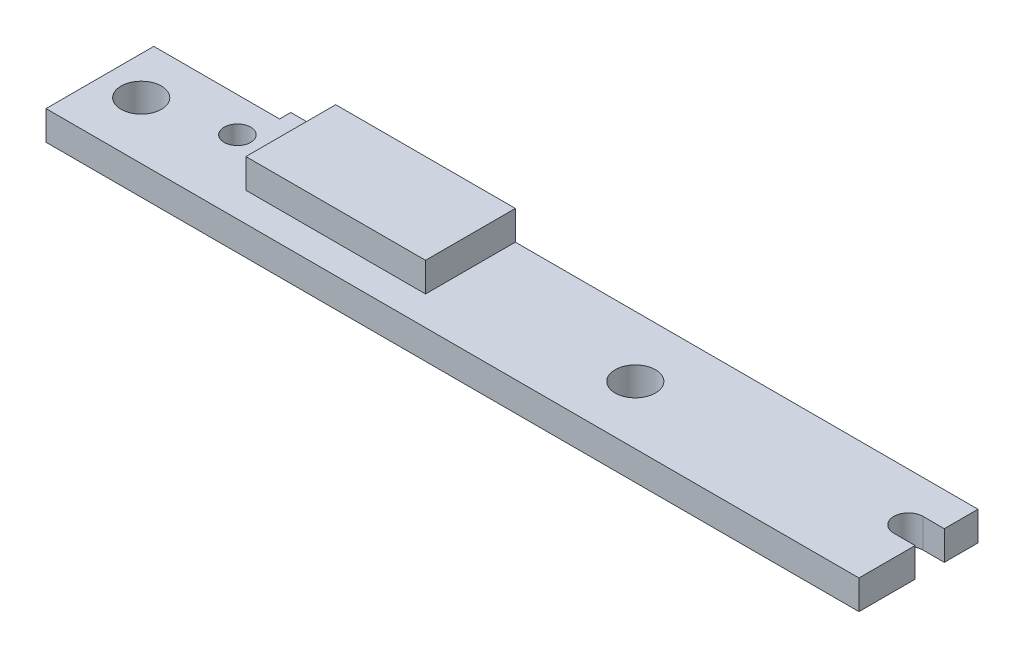
ISO-10303-21;
HEADER;
FILE_DESCRIPTION(('STEP AP214'),'2;1');
FILE_NAME('part.step','',(''),(''),'','','');
FILE_SCHEMA(('AUTOMOTIVE_DESIGN { 1 0 10303 214 1 1 1 1 }'));
ENDSEC;
DATA;
#1=APPLICATION_CONTEXT('core data for automotive mechanical design processes');
#2=APPLICATION_PROTOCOL_DEFINITION('international standard','automotive_design',2000,#1);
#3=PRODUCT_CONTEXT('',#1,'mechanical');
#4=PRODUCT('Part','Part','',(#3));
#5=PRODUCT_RELATED_PRODUCT_CATEGORY('part','',(#4));
#6=PRODUCT_DEFINITION_FORMATION('','',#4);
#7=PRODUCT_DEFINITION_CONTEXT('part definition',#1,'design');
#8=PRODUCT_DEFINITION('design','',#6,#7);
#9=PRODUCT_DEFINITION_SHAPE('','',#8);
#10=(LENGTH_UNIT() NAMED_UNIT(*) SI_UNIT(.MILLI.,.METRE.));
#11=(NAMED_UNIT(*) PLANE_ANGLE_UNIT() SI_UNIT($,.RADIAN.));
#12=(NAMED_UNIT(*) SI_UNIT($,.STERADIAN.) SOLID_ANGLE_UNIT());
#13=UNCERTAINTY_MEASURE_WITH_UNIT(LENGTH_MEASURE(1.E-05),#10,'distance_accuracy_value','');
#14=(GEOMETRIC_REPRESENTATION_CONTEXT(3) GLOBAL_UNCERTAINTY_ASSIGNED_CONTEXT((#13)) GLOBAL_UNIT_ASSIGNED_CONTEXT((#10,
#11,#12)) REPRESENTATION_CONTEXT('',''));
#15=CARTESIAN_POINT('',(0.,0.,0.));
#16=DIRECTION('',(0.,0.,1.));
#17=DIRECTION('',(1.,0.,0.));
#18=AXIS2_PLACEMENT_3D('',#15,#16,#17);
#19=CARTESIAN_POINT('',(44.7675,1.651,-4.0005));
#20=DIRECTION('',(0.,-1.,0.));
#21=DIRECTION('',(0.,0.,-1.));
#22=AXIS2_PLACEMENT_3D('',#19,#20,#21);
#23=CYLINDRICAL_SURFACE('',#22,0.8255);
#24=CARTESIAN_POINT('',(44.7675,0.,-4.0005));
#25=DIRECTION('',(0.,1.,0.));
#26=DIRECTION('',(0.,0.,1.));
#27=AXIS2_PLACEMENT_3D('',#24,#25,#26);
#28=CIRCLE('',#27,0.8255);
#29=CARTESIAN_POINT('',(44.7675,0.,-4.826));
#30=VERTEX_POINT('',#29);
#31=CARTESIAN_POINT('',(44.7675,0.,-3.175));
#32=VERTEX_POINT('',#31);
#33=EDGE_CURVE('E192',#30,#32,#28,.T.);
#34=ORIENTED_EDGE('',*,*,#33,.F.);
#35=DIRECTION('',(0.,-1.,0.));
#36=VECTOR('',#35,1.);
#37=CARTESIAN_POINT('',(44.7675,1.651,-4.826));
#38=LINE('',#37,#36);
#39=CARTESIAN_POINT('',(44.7675,1.651,-4.826));
#40=VERTEX_POINT('',#39);
#41=EDGE_CURVE('E11',#40,#30,#38,.T.);
#42=ORIENTED_EDGE('',*,*,#41,.F.);
#43=CARTESIAN_POINT('',(44.7675,1.651,-4.0005));
#44=DIRECTION('',(0.,1.,0.));
#45=DIRECTION('',(0.,0.,1.));
#46=AXIS2_PLACEMENT_3D('',#43,#44,#45);
#47=CIRCLE('',#46,0.8255);
#48=CARTESIAN_POINT('',(44.7675,1.651,-3.175));
#49=VERTEX_POINT('',#48);
#50=EDGE_CURVE('E327',#40,#49,#47,.T.);
#51=ORIENTED_EDGE('',*,*,#50,.T.);
#52=DIRECTION('',(0.,-1.,0.));
#53=VECTOR('',#52,1.);
#54=CARTESIAN_POINT('',(44.7675,1.651,-3.175));
#55=LINE('',#54,#53);
#56=EDGE_CURVE('E109',#49,#32,#55,.T.);
#57=ORIENTED_EDGE('',*,*,#56,.T.);
#58=EDGE_LOOP('',(#34,#42,#51,#57));
#59=FACE_BOUND('',#58,.T.);
#60=ADVANCED_FACE('F51',(#59),#23,.F.);
#61=CARTESIAN_POINT('',(0.,1.651,-4.82599999999999));
#62=DIRECTION('',(0.,0.,1.));
#63=DIRECTION('',(1.,0.,0.));
#64=AXIS2_PLACEMENT_3D('',#61,#62,#63);
#65=PLANE('',#64);
#66=DIRECTION('',(-1.,0.,0.));
#67=VECTOR('',#66,1.);
#68=CARTESIAN_POINT('',(0.,0.,-4.82599999999999));
#69=LINE('',#68,#67);
#70=CARTESIAN_POINT('',(45.974,0.,-4.826));
#71=VERTEX_POINT('',#70);
#72=EDGE_CURVE('E185',#71,#30,#69,.T.);
#73=ORIENTED_EDGE('',*,*,#72,.F.);
#74=DIRECTION('',(0.,-1.,0.));
#75=VECTOR('',#74,1.);
#76=CARTESIAN_POINT('',(45.974,1.651,-4.826));
#77=LINE('',#76,#75);
#78=CARTESIAN_POINT('',(45.974,1.651,-4.826));
#79=VERTEX_POINT('',#78);
#80=EDGE_CURVE('E60',#79,#71,#77,.T.);
#81=ORIENTED_EDGE('',*,*,#80,.F.);
#82=DIRECTION('',(-1.,0.,0.));
#83=VECTOR('',#82,1.);
#84=CARTESIAN_POINT('',(0.,1.651,-4.82599999999999));
#85=LINE('',#84,#83);
#86=EDGE_CURVE('E329',#79,#40,#85,.T.);
#87=ORIENTED_EDGE('',*,*,#86,.T.);
#88=ORIENTED_EDGE('',*,*,#41,.T.);
#89=EDGE_LOOP('',(#73,#81,#87,#88));
#90=FACE_BOUND('',#89,.T.);
#91=ADVANCED_FACE('F191',(#90),#65,.T.);
#92=CARTESIAN_POINT('',(45.974,1.651,0.));
#93=DIRECTION('',(-1.,0.,0.));
#94=DIRECTION('',(0.,0.,1.));
#95=AXIS2_PLACEMENT_3D('',#92,#93,#94);
#96=PLANE('',#95);
#97=DIRECTION('',(0.,0.,-1.));
#98=VECTOR('',#97,1.);
#99=CARTESIAN_POINT('',(45.974,0.,0.));
#100=LINE('',#99,#98);
#101=CARTESIAN_POINT('',(45.974,0.,-6.731));
#102=VERTEX_POINT('',#101);
#103=EDGE_CURVE('E178',#71,#102,#100,.T.);
#104=ORIENTED_EDGE('',*,*,#103,.T.);
#105=DIRECTION('',(0.,-1.,0.));
#106=VECTOR('',#105,1.);
#107=CARTESIAN_POINT('',(45.974,1.651,-6.731));
#108=LINE('',#107,#106);
#109=CARTESIAN_POINT('',(45.974,1.651,-6.731));
#110=VERTEX_POINT('',#109);
#111=EDGE_CURVE('E170',#110,#102,#108,.T.);
#112=ORIENTED_EDGE('',*,*,#111,.F.);
#113=DIRECTION('',(0.,0.,-1.));
#114=VECTOR('',#113,1.);
#115=CARTESIAN_POINT('',(45.974,1.651,0.));
#116=LINE('',#115,#114);
#117=EDGE_CURVE('E146',#79,#110,#116,.T.);
#118=ORIENTED_EDGE('',*,*,#117,.F.);
#119=ORIENTED_EDGE('',*,*,#80,.T.);
#120=EDGE_LOOP('',(#104,#112,#118,#119));
#121=FACE_BOUND('',#120,.T.);
#122=ADVANCED_FACE('F176',(#121),#96,.F.);
#123=CARTESIAN_POINT('',(0.,1.651,-6.731));
#124=DIRECTION('',(0.,0.,-1.));
#125=DIRECTION('',(-1.,0.,0.));
#126=AXIS2_PLACEMENT_3D('',#123,#124,#125);
#127=PLANE('',#126);
#128=DIRECTION('',(1.,0.,0.));
#129=VECTOR('',#128,1.);
#130=CARTESIAN_POINT('',(0.,0.,-6.731));
#131=LINE('',#130,#129);
#132=CARTESIAN_POINT('',(7.112,0.,-6.731));
#133=VERTEX_POINT('',#132);
#134=EDGE_CURVE('E188',#133,#102,#131,.T.);
#135=ORIENTED_EDGE('',*,*,#134,.F.);
#136=DIRECTION('',(0.,-1.,0.));
#137=VECTOR('',#136,1.);
#138=CARTESIAN_POINT('',(7.112,1.651,-6.731));
#139=LINE('',#138,#137);
#140=CARTESIAN_POINT('',(7.112,1.651,-6.731));
#141=VERTEX_POINT('',#140);
#142=EDGE_CURVE('E168',#141,#133,#139,.T.);
#143=ORIENTED_EDGE('',*,*,#142,.F.);
#144=DIRECTION('',(1.,0.,0.));
#145=VECTOR('',#144,1.);
#146=CARTESIAN_POINT('',(0.,1.651,-6.731));
#147=LINE('',#146,#145);
#148=CARTESIAN_POINT('',(9.652,1.651,-6.731));
#149=VERTEX_POINT('',#148);
#150=EDGE_CURVE('E335',#141,#149,#147,.T.);
#151=ORIENTED_EDGE('',*,*,#150,.T.);
#152=DIRECTION('',(0.,1.,0.));
#153=VECTOR('',#152,1.);
#154=CARTESIAN_POINT('',(9.652,-11.3592253256989,-6.731));
#155=LINE('',#154,#153);
#156=CARTESIAN_POINT('',(9.652,3.302,-6.731));
#157=VERTEX_POINT('',#156);
#158=EDGE_CURVE('E217',#149,#157,#155,.T.);
#159=ORIENTED_EDGE('',*,*,#158,.T.);
#160=DIRECTION('',(-1.,0.,0.));
#161=VECTOR('',#160,1.);
#162=CARTESIAN_POINT('',(9.652,3.302,-6.731));
#163=LINE('',#162,#161);
#164=CARTESIAN_POINT('',(19.812,3.302,-6.731));
#165=VERTEX_POINT('',#164);
#166=EDGE_CURVE('E300',#165,#157,#163,.T.);
#167=ORIENTED_EDGE('',*,*,#166,.F.);
#168=DIRECTION('',(0.,1.,0.));
#169=VECTOR('',#168,1.);
#170=CARTESIAN_POINT('',(19.812,-11.3592253256989,-6.731));
#171=LINE('',#170,#169);
#172=CARTESIAN_POINT('',(19.812,1.651,-6.731));
#173=VERTEX_POINT('',#172);
#174=EDGE_CURVE('E313',#173,#165,#171,.T.);
#175=ORIENTED_EDGE('',*,*,#174,.F.);
#176=EDGE_CURVE('E331',#173,#110,#147,.T.);
#177=ORIENTED_EDGE('',*,*,#176,.T.);
#178=ORIENTED_EDGE('',*,*,#111,.T.);
#179=EDGE_LOOP('',(#135,#143,#151,#159,#167,#175,#177,#178));
#180=FACE_BOUND('',#179,.T.);
#181=ADVANCED_FACE('F242',(#180),#127,.T.);
#182=CARTESIAN_POINT('',(7.11199999999998,1.651,0.));
#183=DIRECTION('',(1.,0.,0.));
#184=DIRECTION('',(0.,0.,-1.));
#185=AXIS2_PLACEMENT_3D('',#182,#183,#184);
#186=PLANE('',#185);
#187=DIRECTION('',(0.,0.,1.));
#188=VECTOR('',#187,1.);
#189=CARTESIAN_POINT('',(7.11199999999998,0.,0.));
#190=LINE('',#189,#188);
#191=CARTESIAN_POINT('',(7.112,0.,-6.096));
#192=VERTEX_POINT('',#191);
#193=EDGE_CURVE('E199',#133,#192,#190,.T.);
#194=ORIENTED_EDGE('',*,*,#193,.T.);
#195=DIRECTION('',(0.,-1.,0.));
#196=VECTOR('',#195,1.);
#197=CARTESIAN_POINT('',(7.112,1.651,-6.096));
#198=LINE('',#197,#196);
#199=CARTESIAN_POINT('',(7.112,1.651,-6.096));
#200=VERTEX_POINT('',#199);
#201=EDGE_CURVE('E166',#200,#192,#198,.T.);
#202=ORIENTED_EDGE('',*,*,#201,.F.);
#203=DIRECTION('',(0.,0.,1.));
#204=VECTOR('',#203,1.);
#205=CARTESIAN_POINT('',(7.11199999999998,1.651,0.));
#206=LINE('',#205,#204);
#207=EDGE_CURVE('E344',#141,#200,#206,.T.);
#208=ORIENTED_EDGE('',*,*,#207,.F.);
#209=ORIENTED_EDGE('',*,*,#142,.T.);
#210=EDGE_LOOP('',(#194,#202,#208,#209));
#211=FACE_BOUND('',#210,.T.);
#212=ADVANCED_FACE('F245',(#211),#186,.F.);
#213=CARTESIAN_POINT('',(0.,1.651,-6.096));
#214=DIRECTION('',(0.,0.,-1.));
#215=DIRECTION('',(-1.,0.,0.));
#216=AXIS2_PLACEMENT_3D('',#213,#214,#215);
#217=PLANE('',#216);
#218=DIRECTION('',(1.,0.,0.));
#219=VECTOR('',#218,1.);
#220=CARTESIAN_POINT('',(0.,0.,-6.096));
#221=LINE('',#220,#219);
#222=CARTESIAN_POINT('',(0.,0.,-6.096));
#223=VERTEX_POINT('',#222);
#224=EDGE_CURVE('E202',#223,#192,#221,.T.);
#225=ORIENTED_EDGE('',*,*,#224,.F.);
#226=DIRECTION('',(0.,-1.,0.));
#227=VECTOR('',#226,1.);
#228=CARTESIAN_POINT('',(0.,1.651,-6.096));
#229=LINE('',#228,#227);
#230=CARTESIAN_POINT('',(0.,1.651,-6.096));
#231=VERTEX_POINT('',#230);
#232=EDGE_CURVE('E160',#231,#223,#229,.T.);
#233=ORIENTED_EDGE('',*,*,#232,.F.);
#234=DIRECTION('',(1.,0.,0.));
#235=VECTOR('',#234,1.);
#236=CARTESIAN_POINT('',(0.,1.651,-6.096));
#237=LINE('',#236,#235);
#238=EDGE_CURVE('E346',#231,#200,#237,.T.);
#239=ORIENTED_EDGE('',*,*,#238,.T.);
#240=ORIENTED_EDGE('',*,*,#201,.T.);
#241=EDGE_LOOP('',(#225,#233,#239,#240));
#242=FACE_BOUND('',#241,.T.);
#243=ADVANCED_FACE('F249',(#242),#217,.T.);
#244=CARTESIAN_POINT('',(0.,1.651,0.));
#245=DIRECTION('',(-1.,0.,0.));
#246=DIRECTION('',(0.,0.,1.));
#247=AXIS2_PLACEMENT_3D('',#244,#245,#246);
#248=PLANE('',#247);
#249=DIRECTION('',(0.,0.,-1.));
#250=VECTOR('',#249,1.);
#251=CARTESIAN_POINT('',(0.,0.,0.));
#252=LINE('',#251,#250);
#253=CARTESIAN_POINT('',(0.,0.,0.));
#254=VERTEX_POINT('',#253);
#255=EDGE_CURVE('E205',#254,#223,#252,.T.);
#256=ORIENTED_EDGE('',*,*,#255,.F.);
#257=DIRECTION('',(0.,-1.,0.));
#258=VECTOR('',#257,1.);
#259=CARTESIAN_POINT('',(0.,1.651,0.));
#260=LINE('',#259,#258);
#261=CARTESIAN_POINT('',(0.,1.651,0.));
#262=VERTEX_POINT('',#261);
#263=EDGE_CURVE('E158',#262,#254,#260,.T.);
#264=ORIENTED_EDGE('',*,*,#263,.F.);
#265=DIRECTION('',(0.,0.,-1.));
#266=VECTOR('',#265,1.);
#267=CARTESIAN_POINT('',(0.,1.651,0.));
#268=LINE('',#267,#266);
#269=EDGE_CURVE('E152',#262,#231,#268,.T.);
#270=ORIENTED_EDGE('',*,*,#269,.T.);
#271=ORIENTED_EDGE('',*,*,#232,.T.);
#272=EDGE_LOOP('',(#256,#264,#270,#271));
#273=FACE_BOUND('',#272,.T.);
#274=ADVANCED_FACE('F253',(#273),#248,.T.);
#275=CARTESIAN_POINT('',(0.,1.651,0.));
#276=DIRECTION('',(0.,0.,-1.));
#277=DIRECTION('',(-1.,0.,0.));
#278=AXIS2_PLACEMENT_3D('',#275,#276,#277);
#279=PLANE('',#278);
#280=DIRECTION('',(1.,0.,0.));
#281=VECTOR('',#280,1.);
#282=CARTESIAN_POINT('',(0.,0.,0.));
#283=LINE('',#282,#281);
#284=CARTESIAN_POINT('',(45.974,0.,0.));
#285=VERTEX_POINT('',#284);
#286=EDGE_CURVE('E157',#254,#285,#283,.T.);
#287=ORIENTED_EDGE('',*,*,#286,.T.);
#288=DIRECTION('',(0.,-1.,0.));
#289=VECTOR('',#288,1.);
#290=CARTESIAN_POINT('',(45.974,1.651,0.));
#291=LINE('',#290,#289);
#292=CARTESIAN_POINT('',(45.974,1.651,0.));
#293=VERTEX_POINT('',#292);
#294=EDGE_CURVE('E141',#293,#285,#291,.T.);
#295=ORIENTED_EDGE('',*,*,#294,.F.);
#296=DIRECTION('',(1.,0.,0.));
#297=VECTOR('',#296,1.);
#298=CARTESIAN_POINT('',(0.,1.651,0.));
#299=LINE('',#298,#297);
#300=EDGE_CURVE('E144',#262,#293,#299,.T.);
#301=ORIENTED_EDGE('',*,*,#300,.F.);
#302=ORIENTED_EDGE('',*,*,#263,.T.);
#303=EDGE_LOOP('',(#287,#295,#301,#302));
#304=FACE_BOUND('',#303,.T.);
#305=ADVANCED_FACE('F155',(#304),#279,.F.);
#306=CARTESIAN_POINT('',(45.974,0.,-3.175));
#307=VERTEX_POINT('',#306);
#308=EDGE_CURVE('E190',#285,#307,#100,.T.);
#309=ORIENTED_EDGE('',*,*,#308,.T.);
#310=DIRECTION('',(0.,-1.,0.));
#311=VECTOR('',#310,1.);
#312=CARTESIAN_POINT('',(45.974,1.651,-3.175));
#313=LINE('',#312,#311);
#314=CARTESIAN_POINT('',(45.974,1.651,-3.175));
#315=VERTEX_POINT('',#314);
#316=EDGE_CURVE('E143',#315,#307,#313,.T.);
#317=ORIENTED_EDGE('',*,*,#316,.F.);
#318=EDGE_CURVE('E136',#293,#315,#116,.T.);
#319=ORIENTED_EDGE('',*,*,#318,.F.);
#320=ORIENTED_EDGE('',*,*,#294,.T.);
#321=EDGE_LOOP('',(#309,#317,#319,#320));
#322=FACE_BOUND('',#321,.T.);
#323=ADVANCED_FACE('F139',(#322),#96,.F.);
#324=CARTESIAN_POINT('',(2.159,1.651,-3.2258));
#325=DIRECTION('',(0.,-1.,0.));
#326=DIRECTION('',(0.,0.,-1.));
#327=AXIS2_PLACEMENT_3D('',#324,#325,#326);
#328=CYLINDRICAL_SURFACE('',#327,1.143);
#329=CARTESIAN_POINT('',(2.159,1.651,-3.2258));
#330=DIRECTION('',(0.,1.,0.));
#331=DIRECTION('',(0.,0.,1.));
#332=AXIS2_PLACEMENT_3D('',#329,#330,#331);
#333=CIRCLE('',#332,1.143);
#334=CARTESIAN_POINT('',(2.159,1.651,-2.0828));
#335=VERTEX_POINT('',#334);
#336=EDGE_CURVE('E325',#335,#335,#333,.T.);
#337=ORIENTED_EDGE('',*,*,#336,.T.);
#338=EDGE_LOOP('',(#337));
#339=FACE_BOUND('',#338,.T.);
#340=CARTESIAN_POINT('',(2.159,0.,-3.2258));
#341=DIRECTION('',(0.,1.,0.));
#342=DIRECTION('',(0.,0.,1.));
#343=AXIS2_PLACEMENT_3D('',#340,#341,#342);
#344=CIRCLE('',#343,1.143);
#345=CARTESIAN_POINT('',(2.159,0.,-2.0828));
#346=VERTEX_POINT('',#345);
#347=EDGE_CURVE('E194',#346,#346,#344,.T.);
#348=ORIENTED_EDGE('',*,*,#347,.F.);
#349=EDGE_LOOP('',(#348));
#350=FACE_BOUND('',#349,.T.);
#351=ADVANCED_FACE('F223',(#339,#350),#328,.F.);
#352=CARTESIAN_POINT('',(6.6936,1.651,-4.1282));
#353=DIRECTION('',(0.,-1.,0.));
#354=DIRECTION('',(0.,0.,-1.));
#355=AXIS2_PLACEMENT_3D('',#352,#353,#354);
#356=CYLINDRICAL_SURFACE('',#355,0.750000000000001);
#357=CARTESIAN_POINT('',(6.6936,1.651,-4.1282));
#358=DIRECTION('',(0.,1.,0.));
#359=DIRECTION('',(0.,0.,1.));
#360=AXIS2_PLACEMENT_3D('',#357,#358,#359);
#361=CIRCLE('',#360,0.750000000000001);
#362=CARTESIAN_POINT('',(6.6936,1.651,-3.3782));
#363=VERTEX_POINT('',#362);
#364=EDGE_CURVE('E322',#363,#363,#361,.T.);
#365=ORIENTED_EDGE('',*,*,#364,.T.);
#366=EDGE_LOOP('',(#365));
#367=FACE_BOUND('',#366,.T.);
#368=CARTESIAN_POINT('',(6.6936,0.,-4.1282));
#369=DIRECTION('',(0.,1.,0.));
#370=DIRECTION('',(0.,0.,1.));
#371=AXIS2_PLACEMENT_3D('',#368,#369,#370);
#372=CIRCLE('',#371,0.750000000000001);
#373=CARTESIAN_POINT('',(6.6936,0.,-3.3782));
#374=VERTEX_POINT('',#373);
#375=EDGE_CURVE('E216',#374,#374,#372,.T.);
#376=ORIENTED_EDGE('',*,*,#375,.F.);
#377=EDGE_LOOP('',(#376));
#378=FACE_BOUND('',#377,.T.);
#379=ADVANCED_FACE('F225',(#367,#378),#356,.F.);
#380=CARTESIAN_POINT('',(30.0228,1.651,-3.302));
#381=DIRECTION('',(0.,-1.,0.));
#382=DIRECTION('',(0.,0.,-1.));
#383=AXIS2_PLACEMENT_3D('',#380,#381,#382);
#384=CYLINDRICAL_SURFACE('',#383,1.143);
#385=CARTESIAN_POINT('',(30.0228,1.651,-3.302));
#386=DIRECTION('',(0.,1.,0.));
#387=DIRECTION('',(0.,0.,1.));
#388=AXIS2_PLACEMENT_3D('',#385,#386,#387);
#389=CIRCLE('',#388,1.143);
#390=CARTESIAN_POINT('',(30.0228,1.651,-2.159));
#391=VERTEX_POINT('',#390);
#392=EDGE_CURVE('E209',#391,#391,#389,.T.);
#393=ORIENTED_EDGE('',*,*,#392,.T.);
#394=EDGE_LOOP('',(#393));
#395=FACE_BOUND('',#394,.T.);
#396=CARTESIAN_POINT('',(30.0228,0.,-3.302));
#397=DIRECTION('',(0.,1.,0.));
#398=DIRECTION('',(0.,0.,1.));
#399=AXIS2_PLACEMENT_3D('',#396,#397,#398);
#400=CIRCLE('',#399,1.143);
#401=CARTESIAN_POINT('',(30.0228,0.,-2.159));
#402=VERTEX_POINT('',#401);
#403=EDGE_CURVE('E213',#402,#402,#400,.T.);
#404=ORIENTED_EDGE('',*,*,#403,.F.);
#405=EDGE_LOOP('',(#404));
#406=FACE_BOUND('',#405,.T.);
#407=ADVANCED_FACE('F53',(#395,#406),#384,.F.);
#408=CARTESIAN_POINT('',(0.,1.651,-3.17499999999999));
#409=DIRECTION('',(0.,0.,1.));
#410=DIRECTION('',(1.,0.,0.));
#411=AXIS2_PLACEMENT_3D('',#408,#409,#410);
#412=PLANE('',#411);
#413=DIRECTION('',(-1.,0.,0.));
#414=VECTOR('',#413,1.);
#415=CARTESIAN_POINT('',(0.,0.,-3.17499999999999));
#416=LINE('',#415,#414);
#417=EDGE_CURVE('E102',#307,#32,#416,.T.);
#418=ORIENTED_EDGE('',*,*,#417,.T.);
#419=ORIENTED_EDGE('',*,*,#56,.F.);
#420=DIRECTION('',(-1.,0.,0.));
#421=VECTOR('',#420,1.);
#422=CARTESIAN_POINT('',(0.,1.651,-3.17499999999999));
#423=LINE('',#422,#421);
#424=EDGE_CURVE('E68',#315,#49,#423,.T.);
#425=ORIENTED_EDGE('',*,*,#424,.F.);
#426=ORIENTED_EDGE('',*,*,#316,.T.);
#427=EDGE_LOOP('',(#418,#419,#425,#426));
#428=FACE_BOUND('',#427,.T.);
#429=ADVANCED_FACE('F260',(#428),#412,.F.);
#430=CARTESIAN_POINT('',(0.,1.651,0.));
#431=DIRECTION('',(0.,1.,0.));
#432=DIRECTION('',(0.,0.,1.));
#433=AXIS2_PLACEMENT_3D('',#430,#431,#432);
#434=PLANE('',#433);
#435=ORIENTED_EDGE('',*,*,#392,.F.);
#436=EDGE_LOOP('',(#435));
#437=FACE_BOUND('',#436,.T.);
#438=ORIENTED_EDGE('',*,*,#364,.F.);
#439=EDGE_LOOP('',(#438));
#440=FACE_BOUND('',#439,.T.);
#441=ORIENTED_EDGE('',*,*,#336,.F.);
#442=EDGE_LOOP('',(#441));
#443=FACE_BOUND('',#442,.T.);
#444=ORIENTED_EDGE('',*,*,#50,.F.);
#445=ORIENTED_EDGE('',*,*,#86,.F.);
#446=ORIENTED_EDGE('',*,*,#117,.T.);
#447=ORIENTED_EDGE('',*,*,#176,.F.);
#448=DIRECTION('',(0.,0.,1.));
#449=VECTOR('',#448,1.);
#450=CARTESIAN_POINT('',(19.812,1.651,0.));
#451=LINE('',#450,#449);
#452=CARTESIAN_POINT('',(19.812,1.651,-1.651));
#453=VERTEX_POINT('',#452);
#454=EDGE_CURVE('E334',#173,#453,#451,.T.);
#455=ORIENTED_EDGE('',*,*,#454,.T.);
#456=DIRECTION('',(1.,0.,0.));
#457=VECTOR('',#456,1.);
#458=CARTESIAN_POINT('',(0.,1.651,-1.651));
#459=LINE('',#458,#457);
#460=CARTESIAN_POINT('',(9.652,1.651,-1.651));
#461=VERTEX_POINT('',#460);
#462=EDGE_CURVE('E338',#461,#453,#459,.T.);
#463=ORIENTED_EDGE('',*,*,#462,.F.);
#464=DIRECTION('',(0.,0.,1.));
#465=VECTOR('',#464,1.);
#466=CARTESIAN_POINT('',(9.652,1.651,0.));
#467=LINE('',#466,#465);
#468=EDGE_CURVE('E341',#149,#461,#467,.T.);
#469=ORIENTED_EDGE('',*,*,#468,.F.);
#470=ORIENTED_EDGE('',*,*,#150,.F.);
#471=ORIENTED_EDGE('',*,*,#207,.T.);
#472=ORIENTED_EDGE('',*,*,#238,.F.);
#473=ORIENTED_EDGE('',*,*,#269,.F.);
#474=ORIENTED_EDGE('',*,*,#300,.T.);
#475=ORIENTED_EDGE('',*,*,#318,.T.);
#476=ORIENTED_EDGE('',*,*,#424,.T.);
#477=EDGE_LOOP('',(#444,#445,#446,#447,#455,#463,#469,#470,#471,#472,#473,#474,#475,#476));
#478=FACE_BOUND('',#477,.T.);
#479=ADVANCED_FACE('F149',(#437,#440,#443,#478),#434,.T.);
#480=CARTESIAN_POINT('',(0.,0.,0.));
#481=DIRECTION('',(0.,1.,0.));
#482=DIRECTION('',(0.,0.,1.));
#483=AXIS2_PLACEMENT_3D('',#480,#481,#482);
#484=PLANE('',#483);
#485=ORIENTED_EDGE('',*,*,#403,.T.);
#486=EDGE_LOOP('',(#485));
#487=FACE_BOUND('',#486,.T.);
#488=ORIENTED_EDGE('',*,*,#375,.T.);
#489=EDGE_LOOP('',(#488));
#490=FACE_BOUND('',#489,.T.);
#491=ORIENTED_EDGE('',*,*,#347,.T.);
#492=EDGE_LOOP('',(#491));
#493=FACE_BOUND('',#492,.T.);
#494=ORIENTED_EDGE('',*,*,#33,.T.);
#495=ORIENTED_EDGE('',*,*,#417,.F.);
#496=ORIENTED_EDGE('',*,*,#308,.F.);
#497=ORIENTED_EDGE('',*,*,#286,.F.);
#498=ORIENTED_EDGE('',*,*,#255,.T.);
#499=ORIENTED_EDGE('',*,*,#224,.T.);
#500=ORIENTED_EDGE('',*,*,#193,.F.);
#501=ORIENTED_EDGE('',*,*,#134,.T.);
#502=ORIENTED_EDGE('',*,*,#103,.F.);
#503=ORIENTED_EDGE('',*,*,#72,.T.);
#504=EDGE_LOOP('',(#494,#495,#496,#497,#498,#499,#500,#501,#502,#503));
#505=FACE_BOUND('',#504,.T.);
#506=ADVANCED_FACE('F184',(#487,#490,#493,#505),#484,.F.);
#507=CARTESIAN_POINT('',(9.652,-11.3592253256989,-6.731));
#508=DIRECTION('',(-1.,0.,0.));
#509=DIRECTION('',(0.,0.,1.));
#510=AXIS2_PLACEMENT_3D('',#507,#508,#509);
#511=PLANE('',#510);
#512=ORIENTED_EDGE('',*,*,#158,.F.);
#513=ORIENTED_EDGE('',*,*,#468,.T.);
#514=DIRECTION('',(0.,1.,0.));
#515=VECTOR('',#514,1.);
#516=CARTESIAN_POINT('',(9.652,-11.3592253256989,-1.651));
#517=LINE('',#516,#515);
#518=CARTESIAN_POINT('',(9.652,3.302,-1.651));
#519=VERTEX_POINT('',#518);
#520=EDGE_CURVE('E310',#461,#519,#517,.T.);
#521=ORIENTED_EDGE('',*,*,#520,.T.);
#522=DIRECTION('',(0.,0.,1.));
#523=VECTOR('',#522,1.);
#524=CARTESIAN_POINT('',(9.652,3.302,-6.731));
#525=LINE('',#524,#523);
#526=EDGE_CURVE('E292',#157,#519,#525,.T.);
#527=ORIENTED_EDGE('',*,*,#526,.F.);
#528=EDGE_LOOP('',(#512,#513,#521,#527));
#529=FACE_BOUND('',#528,.T.);
#530=ADVANCED_FACE('F266',(#529),#511,.T.);
#531=CARTESIAN_POINT('',(19.812,-11.3592253256989,-6.731));
#532=DIRECTION('',(1.,0.,0.));
#533=DIRECTION('',(0.,0.,-1.));
#534=AXIS2_PLACEMENT_3D('',#531,#532,#533);
#535=PLANE('',#534);
#536=DIRECTION('',(0.,1.,0.));
#537=VECTOR('',#536,1.);
#538=CARTESIAN_POINT('',(19.812,-11.3592253256989,-1.651));
#539=LINE('',#538,#537);
#540=CARTESIAN_POINT('',(19.812,3.302,-1.651));
#541=VERTEX_POINT('',#540);
#542=EDGE_CURVE('E316',#453,#541,#539,.T.);
#543=ORIENTED_EDGE('',*,*,#542,.F.);
#544=ORIENTED_EDGE('',*,*,#454,.F.);
#545=ORIENTED_EDGE('',*,*,#174,.T.);
#546=DIRECTION('',(0.,0.,-1.));
#547=VECTOR('',#546,1.);
#548=CARTESIAN_POINT('',(19.812,3.302,-6.731));
#549=LINE('',#548,#547);
#550=EDGE_CURVE('E305',#541,#165,#549,.T.);
#551=ORIENTED_EDGE('',*,*,#550,.F.);
#552=EDGE_LOOP('',(#543,#544,#545,#551));
#553=FACE_BOUND('',#552,.T.);
#554=ADVANCED_FACE('F273',(#553),#535,.T.);
#555=CARTESIAN_POINT('',(9.652,-11.3592253256989,-1.651));
#556=DIRECTION('',(0.,0.,1.));
#557=DIRECTION('',(1.,0.,0.));
#558=AXIS2_PLACEMENT_3D('',#555,#556,#557);
#559=PLANE('',#558);
#560=ORIENTED_EDGE('',*,*,#520,.F.);
#561=ORIENTED_EDGE('',*,*,#462,.T.);
#562=ORIENTED_EDGE('',*,*,#542,.T.);
#563=DIRECTION('',(1.,0.,0.));
#564=VECTOR('',#563,1.);
#565=CARTESIAN_POINT('',(9.652,3.302,-1.651));
#566=LINE('',#565,#564);
#567=EDGE_CURVE('E296',#519,#541,#566,.T.);
#568=ORIENTED_EDGE('',*,*,#567,.F.);
#569=EDGE_LOOP('',(#560,#561,#562,#568));
#570=FACE_BOUND('',#569,.T.);
#571=ADVANCED_FACE('F275',(#570),#559,.T.);
#572=CARTESIAN_POINT('',(0.,3.302,0.));
#573=DIRECTION('',(0.,1.,0.));
#574=DIRECTION('',(0.,0.,1.));
#575=AXIS2_PLACEMENT_3D('',#572,#573,#574);
#576=PLANE('',#575);
#577=ORIENTED_EDGE('',*,*,#526,.T.);
#578=ORIENTED_EDGE('',*,*,#567,.T.);
#579=ORIENTED_EDGE('',*,*,#550,.T.);
#580=ORIENTED_EDGE('',*,*,#166,.T.);
#581=EDGE_LOOP('',(#577,#578,#579,#580));
#582=FACE_BOUND('',#581,.T.);
#583=ADVANCED_FACE('F278',(#582),#576,.T.);
#584=CLOSED_SHELL('',(#60,#91,#122,#181,#212,#243,#274,#305,#323,#351,#379,#407,#429,#479,#506,
#530,#554,#571,#583));
#585=MANIFOLD_SOLID_BREP('B2',#584);
#586=ADVANCED_BREP_SHAPE_REPRESENTATION('',(#18,#585),#14);
#587=SHAPE_DEFINITION_REPRESENTATION(#9,#586);
ENDSEC;
END-ISO-10303-21;
